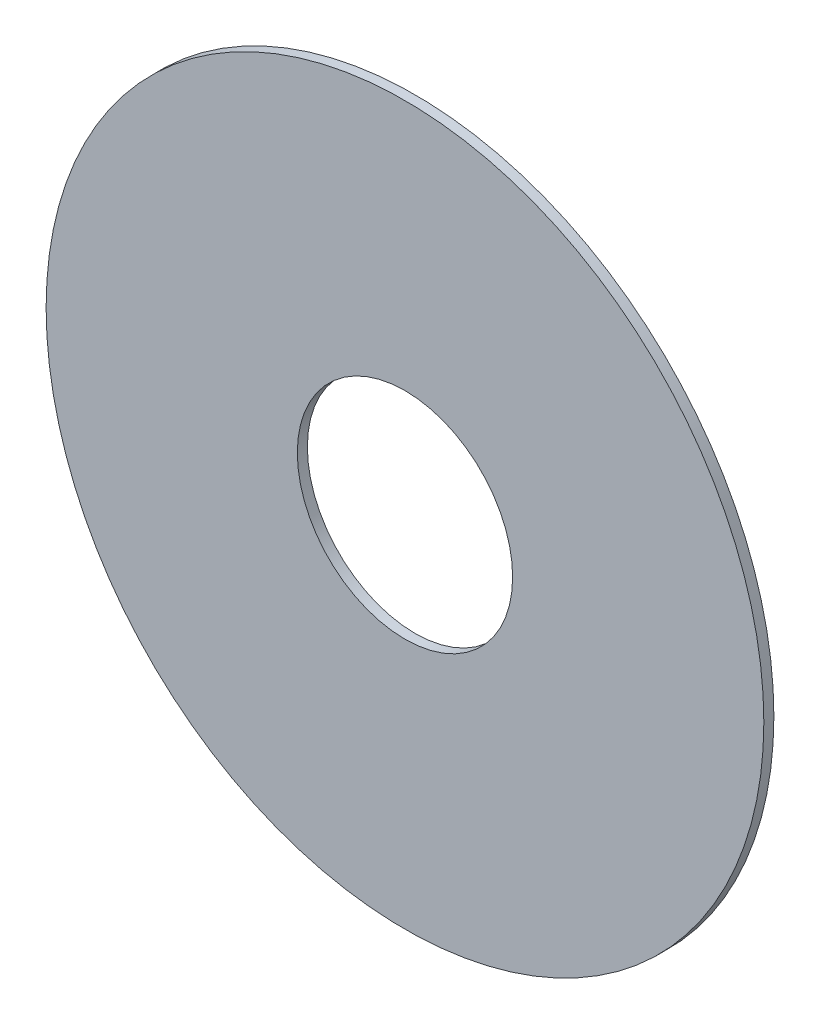
ISO-10303-21;
HEADER;
FILE_DESCRIPTION(('STEP AP214'),'2;1');
FILE_NAME('part.step','',(''),(''),'','','');
FILE_SCHEMA(('AUTOMOTIVE_DESIGN { 1 0 10303 214 1 1 1 1 }'));
ENDSEC;
DATA;
#1=APPLICATION_CONTEXT('core data for automotive mechanical design processes');
#2=APPLICATION_PROTOCOL_DEFINITION('international standard','automotive_design',2000,#1);
#3=PRODUCT_CONTEXT('',#1,'mechanical');
#4=PRODUCT('Part','Part','',(#3));
#5=PRODUCT_RELATED_PRODUCT_CATEGORY('part','',(#4));
#6=PRODUCT_DEFINITION_FORMATION('','',#4);
#7=PRODUCT_DEFINITION_CONTEXT('part definition',#1,'design');
#8=PRODUCT_DEFINITION('design','',#6,#7);
#9=PRODUCT_DEFINITION_SHAPE('','',#8);
#10=(LENGTH_UNIT() NAMED_UNIT(*) SI_UNIT(.MILLI.,.METRE.));
#11=(NAMED_UNIT(*) PLANE_ANGLE_UNIT() SI_UNIT($,.RADIAN.));
#12=(NAMED_UNIT(*) SI_UNIT($,.STERADIAN.) SOLID_ANGLE_UNIT());
#13=UNCERTAINTY_MEASURE_WITH_UNIT(LENGTH_MEASURE(1.E-05),#10,'distance_accuracy_value','');
#14=(GEOMETRIC_REPRESENTATION_CONTEXT(3) GLOBAL_UNCERTAINTY_ASSIGNED_CONTEXT((#13)) GLOBAL_UNIT_ASSIGNED_CONTEXT((#10,
#11,#12)) REPRESENTATION_CONTEXT('',''));
#15=CARTESIAN_POINT('',(0.,0.,0.));
#16=DIRECTION('',(0.,0.,1.));
#17=DIRECTION('',(1.,0.,0.));
#18=AXIS2_PLACEMENT_3D('',#15,#16,#17);
#19=CARTESIAN_POINT('',(170.18,-120.396,-0.045));
#20=DIRECTION('',(0.,0.,-1.));
#21=DIRECTION('',(0.,-1.,0.));
#22=AXIS2_PLACEMENT_3D('',#19,#20,#21);
#23=CYLINDRICAL_SURFACE('',#22,0.375);
#24=CARTESIAN_POINT('',(170.18,-120.396,-0.035));
#25=DIRECTION('',(0.,0.,-1.));
#26=DIRECTION('',(0.,-1.,0.));
#27=AXIS2_PLACEMENT_3D('',#24,#25,#26);
#28=CIRCLE('',#27,0.375);
#29=CARTESIAN_POINT('',(170.18,-120.771,-0.035));
#30=VERTEX_POINT('',#29);
#31=EDGE_CURVE('E26',#30,#30,#28,.T.);
#32=ORIENTED_EDGE('',*,*,#31,.T.);
#33=DIRECTION('',(0.,0.,1.));
#34=VECTOR('',#33,1.);
#35=CARTESIAN_POINT('',(170.18,-120.771,-0.045));
#36=LINE('',#35,#34);
#37=CARTESIAN_POINT('',(170.18,-120.771,0.));
#38=VERTEX_POINT('',#37);
#39=EDGE_CURVE('E11',#30,#38,#36,.T.);
#40=ORIENTED_EDGE('',*,*,#39,.T.);
#41=CARTESIAN_POINT('',(170.18,-120.396,0.));
#42=DIRECTION('',(0.,0.,-1.));
#43=DIRECTION('',(0.,-1.,0.));
#44=AXIS2_PLACEMENT_3D('',#41,#42,#43);
#45=CIRCLE('',#44,0.375);
#46=EDGE_CURVE('E66',#38,#38,#45,.T.);
#47=ORIENTED_EDGE('',*,*,#46,.F.);
#48=ORIENTED_EDGE('',*,*,#39,.F.);
#49=EDGE_LOOP('',(#32,#40,#47,#48));
#50=FACE_BOUND('',#49,.T.);
#51=ADVANCED_FACE('F17',(#50),#23,.F.);
#52=CARTESIAN_POINT('',(170.18,-120.396,-0.035));
#53=DIRECTION('',(0.,0.,1.));
#54=DIRECTION('',(1.,0.,0.));
#55=AXIS2_PLACEMENT_3D('',#52,#53,#54);
#56=PLANE('',#55);
#57=ORIENTED_EDGE('',*,*,#31,.F.);
#58=EDGE_LOOP('',(#57));
#59=FACE_BOUND('',#58,.T.);
#60=CARTESIAN_POINT('',(170.18,-120.396,-0.035));
#61=DIRECTION('',(0.,0.,1.));
#62=DIRECTION('',(1.,0.,0.));
#63=AXIS2_PLACEMENT_3D('',#60,#61,#62);
#64=CIRCLE('',#63,1.25);
#65=CARTESIAN_POINT('',(171.43,-120.396,-0.035));
#66=VERTEX_POINT('',#65);
#67=EDGE_CURVE('E47',#66,#66,#64,.T.);
#68=ORIENTED_EDGE('',*,*,#67,.F.);
#69=EDGE_LOOP('',(#68));
#70=FACE_BOUND('',#69,.T.);
#71=ADVANCED_FACE('F76',(#59,#70),#56,.F.);
#72=CARTESIAN_POINT('',(170.18,-120.396,0.));
#73=DIRECTION('',(0.,0.,1.));
#74=DIRECTION('',(1.,0.,0.));
#75=AXIS2_PLACEMENT_3D('',#72,#73,#74);
#76=PLANE('',#75);
#77=ORIENTED_EDGE('',*,*,#46,.T.);
#78=EDGE_LOOP('',(#77));
#79=FACE_BOUND('',#78,.T.);
#80=CARTESIAN_POINT('',(170.18,-120.396,0.));
#81=DIRECTION('',(0.,0.,1.));
#82=DIRECTION('',(1.,0.,0.));
#83=AXIS2_PLACEMENT_3D('',#80,#81,#82);
#84=CIRCLE('',#83,1.25);
#85=CARTESIAN_POINT('',(171.43,-120.396,0.));
#86=VERTEX_POINT('',#85);
#87=EDGE_CURVE('E54',#86,#86,#84,.T.);
#88=ORIENTED_EDGE('',*,*,#87,.T.);
#89=EDGE_LOOP('',(#88));
#90=FACE_BOUND('',#89,.T.);
#91=ADVANCED_FACE('F58',(#79,#90),#76,.T.);
#92=CARTESIAN_POINT('',(170.18,-120.396,-0.035));
#93=DIRECTION('',(0.,0.,1.));
#94=DIRECTION('',(1.,0.,0.));
#95=AXIS2_PLACEMENT_3D('',#92,#93,#94);
#96=CYLINDRICAL_SURFACE('',#95,1.25);
#97=ORIENTED_EDGE('',*,*,#87,.F.);
#98=DIRECTION('',(0.,0.,1.));
#99=VECTOR('',#98,1.);
#100=CARTESIAN_POINT('',(171.43,-120.396,-0.035));
#101=LINE('',#100,#99);
#102=EDGE_CURVE('E51',#66,#86,#101,.T.);
#103=ORIENTED_EDGE('',*,*,#102,.F.);
#104=ORIENTED_EDGE('',*,*,#67,.T.);
#105=ORIENTED_EDGE('',*,*,#102,.T.);
#106=EDGE_LOOP('',(#97,#103,#104,#105));
#107=FACE_BOUND('',#106,.T.);
#108=ADVANCED_FACE('F53',(#107),#96,.T.);
#109=CLOSED_SHELL('',(#51,#71,#91,#108));
#110=MANIFOLD_SOLID_BREP('B1',#109);
#111=ADVANCED_BREP_SHAPE_REPRESENTATION('',(#18,#110),#14);
#112=SHAPE_DEFINITION_REPRESENTATION(#9,#111);
ENDSEC;
END-ISO-10303-21;
